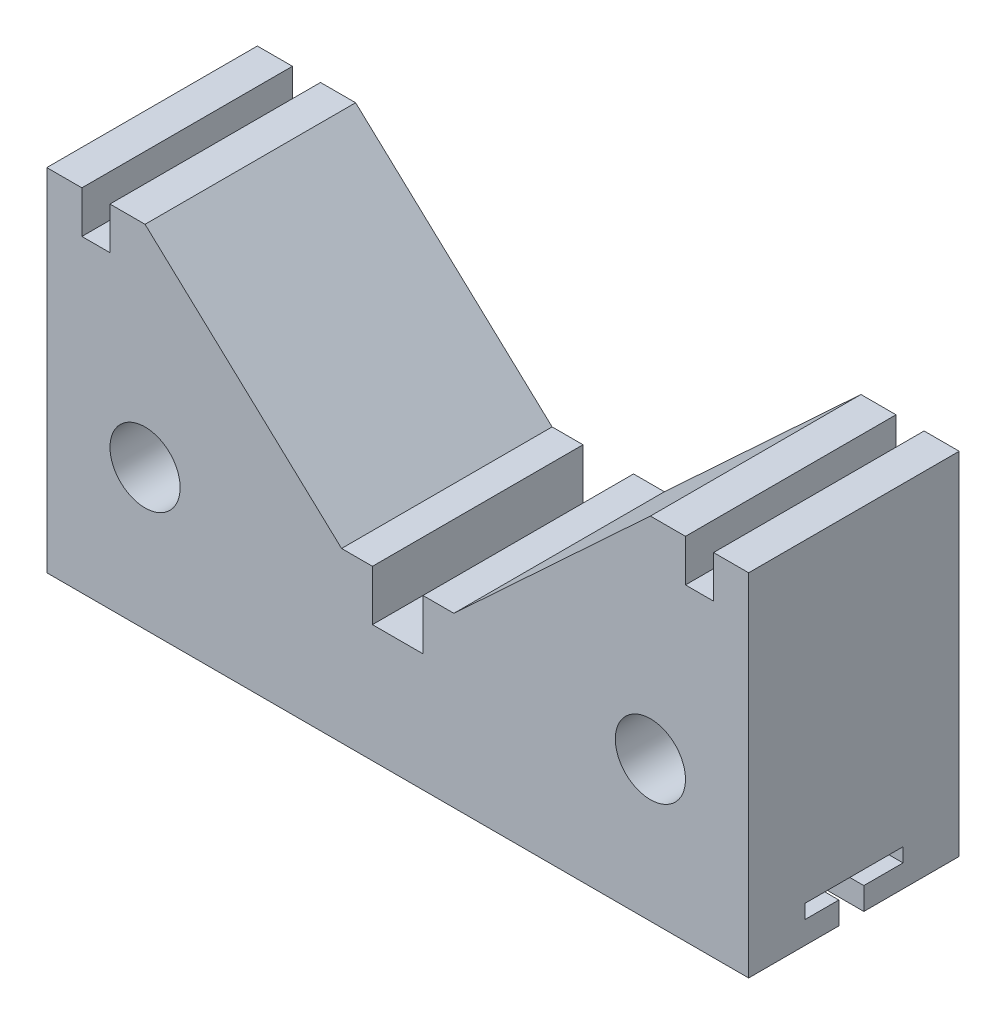
ISO-10303-21;
HEADER;
FILE_DESCRIPTION(('STEP AP214'),'2;1');
FILE_NAME('part.step','',(''),(''),'','','');
FILE_SCHEMA(('AUTOMOTIVE_DESIGN { 1 0 10303 214 1 1 1 1 }'));
ENDSEC;
DATA;
#1=APPLICATION_CONTEXT('core data for automotive mechanical design processes');
#2=APPLICATION_PROTOCOL_DEFINITION('international standard','automotive_design',2000,#1);
#3=PRODUCT_CONTEXT('',#1,'mechanical');
#4=PRODUCT('Part','Part','',(#3));
#5=PRODUCT_RELATED_PRODUCT_CATEGORY('part','',(#4));
#6=PRODUCT_DEFINITION_FORMATION('','',#4);
#7=PRODUCT_DEFINITION_CONTEXT('part definition',#1,'design');
#8=PRODUCT_DEFINITION('design','',#6,#7);
#9=PRODUCT_DEFINITION_SHAPE('','',#8);
#10=(LENGTH_UNIT() NAMED_UNIT(*) SI_UNIT(.MILLI.,.METRE.));
#11=(NAMED_UNIT(*) PLANE_ANGLE_UNIT() SI_UNIT($,.RADIAN.));
#12=(NAMED_UNIT(*) SI_UNIT($,.STERADIAN.) SOLID_ANGLE_UNIT());
#13=UNCERTAINTY_MEASURE_WITH_UNIT(LENGTH_MEASURE(1.E-05),#10,'distance_accuracy_value','');
#14=(GEOMETRIC_REPRESENTATION_CONTEXT(3) GLOBAL_UNCERTAINTY_ASSIGNED_CONTEXT((#13)) GLOBAL_UNIT_ASSIGNED_CONTEXT((#10,
#11,#12)) REPRESENTATION_CONTEXT('',''));
#15=CARTESIAN_POINT('',(0.,0.,0.));
#16=DIRECTION('',(0.,0.,1.));
#17=DIRECTION('',(1.,0.,0.));
#18=AXIS2_PLACEMENT_3D('',#15,#16,#17);
#19=CARTESIAN_POINT('',(-125.,0.,37.5));
#20=DIRECTION('',(0.,1.,0.));
#21=DIRECTION('',(0.,0.,1.));
#22=AXIS2_PLACEMENT_3D('',#19,#20,#21);
#23=PLANE('',#22);
#24=DIRECTION('',(0.,0.,-1.));
#25=VECTOR('',#24,1.);
#26=CARTESIAN_POINT('',(125.,0.,37.5));
#27=LINE('',#26,#25);
#28=CARTESIAN_POINT('',(125.,0.,-3.53011705495498));
#29=VERTEX_POINT('',#28);
#30=CARTESIAN_POINT('',(125.,0.,-37.5));
#31=VERTEX_POINT('',#30);
#32=EDGE_CURVE('E127',#29,#31,#27,.T.);
#33=ORIENTED_EDGE('',*,*,#32,.F.);
#34=DIRECTION('',(-1.,0.,0.));
#35=VECTOR('',#34,1.);
#36=CARTESIAN_POINT('',(-125.,0.,-3.53011705495498));
#37=LINE('',#36,#35);
#38=CARTESIAN_POINT('',(-125.,0.,-3.53011705495498));
#39=VERTEX_POINT('',#38);
#40=EDGE_CURVE('E315',#29,#39,#37,.T.);
#41=ORIENTED_EDGE('',*,*,#40,.T.);
#42=DIRECTION('',(0.,0.,-1.));
#43=VECTOR('',#42,1.);
#44=CARTESIAN_POINT('',(-125.,0.,37.5));
#45=LINE('',#44,#43);
#46=CARTESIAN_POINT('',(-125.,0.,-37.5));
#47=VERTEX_POINT('',#46);
#48=EDGE_CURVE('E263',#39,#47,#45,.T.);
#49=ORIENTED_EDGE('',*,*,#48,.T.);
#50=DIRECTION('',(1.,0.,0.));
#51=VECTOR('',#50,1.);
#52=CARTESIAN_POINT('',(-125.,0.,-37.5));
#53=LINE('',#52,#51);
#54=EDGE_CURVE('E257',#47,#31,#53,.T.);
#55=ORIENTED_EDGE('',*,*,#54,.T.);
#56=EDGE_LOOP('',(#33,#41,#49,#55));
#57=FACE_BOUND('',#56,.T.);
#58=ADVANCED_FACE('F33',(#57),#23,.F.);
#59=CARTESIAN_POINT('',(0.,0.,37.5));
#60=DIRECTION('',(0.,0.,1.));
#61=DIRECTION('',(1.,0.,0.));
#62=AXIS2_PLACEMENT_3D('',#59,#60,#61);
#63=PLANE('',#62);
#64=CARTESIAN_POINT('',(-90.,50.,37.5));
#65=DIRECTION('',(0.,0.,1.));
#66=DIRECTION('',(1.,0.,0.));
#67=AXIS2_PLACEMENT_3D('',#64,#65,#66);
#68=CIRCLE('',#67,12.5);
#69=CARTESIAN_POINT('',(-77.5,50.,37.5));
#70=VERTEX_POINT('',#69);
#71=EDGE_CURVE('E222',#70,#70,#68,.T.);
#72=ORIENTED_EDGE('',*,*,#71,.F.);
#73=EDGE_LOOP('',(#72));
#74=FACE_BOUND('',#73,.T.);
#75=DIRECTION('',(0.,1.,0.));
#76=VECTOR('',#75,1.);
#77=CARTESIAN_POINT('',(125.,0.,37.5));
#78=LINE('',#77,#76);
#79=CARTESIAN_POINT('',(125.,0.,37.5));
#80=VERTEX_POINT('',#79);
#81=CARTESIAN_POINT('',(125.,125.,37.5));
#82=VERTEX_POINT('',#81);
#83=EDGE_CURVE('E259',#80,#82,#78,.T.);
#84=ORIENTED_EDGE('',*,*,#83,.T.);
#85=DIRECTION('',(-1.,0.,0.));
#86=VECTOR('',#85,1.);
#87=CARTESIAN_POINT('',(125.,125.,37.5));
#88=LINE('',#87,#86);
#89=CARTESIAN_POINT('',(112.5,125.,37.5));
#90=VERTEX_POINT('',#89);
#91=EDGE_CURVE('E136',#82,#90,#88,.T.);
#92=ORIENTED_EDGE('',*,*,#91,.T.);
#93=DIRECTION('',(0.,-1.,0.));
#94=VECTOR('',#93,1.);
#95=CARTESIAN_POINT('',(112.5,125.,37.5));
#96=LINE('',#95,#94);
#97=CARTESIAN_POINT('',(112.5,110.,37.5));
#98=VERTEX_POINT('',#97);
#99=EDGE_CURVE('E386',#90,#98,#96,.T.);
#100=ORIENTED_EDGE('',*,*,#99,.T.);
#101=DIRECTION('',(-1.,0.,0.));
#102=VECTOR('',#101,1.);
#103=CARTESIAN_POINT('',(112.5,110.,37.5));
#104=LINE('',#103,#102);
#105=CARTESIAN_POINT('',(102.5,110.,37.5));
#106=VERTEX_POINT('',#105);
#107=EDGE_CURVE('E388',#98,#106,#104,.T.);
#108=ORIENTED_EDGE('',*,*,#107,.T.);
#109=DIRECTION('',(0.,1.,0.));
#110=VECTOR('',#109,1.);
#111=CARTESIAN_POINT('',(102.5,110.,37.5));
#112=LINE('',#111,#110);
#113=CARTESIAN_POINT('',(102.5,125.,37.5));
#114=VERTEX_POINT('',#113);
#115=EDGE_CURVE('E390',#106,#114,#112,.T.);
#116=ORIENTED_EDGE('',*,*,#115,.T.);
#117=DIRECTION('',(-1.,0.,0.));
#118=VECTOR('',#117,1.);
#119=CARTESIAN_POINT('',(102.5,125.,37.5));
#120=LINE('',#119,#118);
#121=CARTESIAN_POINT('',(90.,125.,37.5));
#122=VERTEX_POINT('',#121);
#123=EDGE_CURVE('E392',#114,#122,#120,.T.);
#124=ORIENTED_EDGE('',*,*,#123,.T.);
#125=DIRECTION('',(-0.732793491626299,-0.680451099367278,0.));
#126=VECTOR('',#125,1.);
#127=CARTESIAN_POINT('',(90.,125.,37.5));
#128=LINE('',#127,#126);
#129=CARTESIAN_POINT('',(20.,60.,37.5));
#130=VERTEX_POINT('',#129);
#131=EDGE_CURVE('E394',#122,#130,#128,.T.);
#132=ORIENTED_EDGE('',*,*,#131,.T.);
#133=DIRECTION('',(-1.,0.,0.));
#134=VECTOR('',#133,1.);
#135=CARTESIAN_POINT('',(20.,60.,37.5));
#136=LINE('',#135,#134);
#137=CARTESIAN_POINT('',(8.99999999999999,60.,37.5));
#138=VERTEX_POINT('',#137);
#139=EDGE_CURVE('E396',#130,#138,#136,.T.);
#140=ORIENTED_EDGE('',*,*,#139,.T.);
#141=DIRECTION('',(0.,-1.,0.));
#142=VECTOR('',#141,1.);
#143=CARTESIAN_POINT('',(8.99999999999999,60.,37.5));
#144=LINE('',#143,#142);
#145=CARTESIAN_POINT('',(9.,42.,37.5));
#146=VERTEX_POINT('',#145);
#147=EDGE_CURVE('E398',#138,#146,#144,.T.);
#148=ORIENTED_EDGE('',*,*,#147,.T.);
#149=DIRECTION('',(-1.,0.,0.));
#150=VECTOR('',#149,1.);
#151=CARTESIAN_POINT('',(9.,42.,37.5));
#152=LINE('',#151,#150);
#153=CARTESIAN_POINT('',(-9.,42.,37.5));
#154=VERTEX_POINT('',#153);
#155=EDGE_CURVE('E400',#146,#154,#152,.T.);
#156=ORIENTED_EDGE('',*,*,#155,.T.);
#157=DIRECTION('',(0.,1.,0.));
#158=VECTOR('',#157,1.);
#159=CARTESIAN_POINT('',(-8.99999999999999,60.,37.5));
#160=LINE('',#159,#158);
#161=CARTESIAN_POINT('',(-8.99999999999999,60.,37.5));
#162=VERTEX_POINT('',#161);
#163=EDGE_CURVE('E402',#154,#162,#160,.T.);
#164=ORIENTED_EDGE('',*,*,#163,.T.);
#165=DIRECTION('',(-1.,0.,0.));
#166=VECTOR('',#165,1.);
#167=CARTESIAN_POINT('',(-20.,60.,37.5));
#168=LINE('',#167,#166);
#169=CARTESIAN_POINT('',(-20.,60.,37.5));
#170=VERTEX_POINT('',#169);
#171=EDGE_CURVE('E404',#162,#170,#168,.T.);
#172=ORIENTED_EDGE('',*,*,#171,.T.);
#173=DIRECTION('',(-0.732793491626299,0.680451099367277,0.));
#174=VECTOR('',#173,1.);
#175=CARTESIAN_POINT('',(-90.,125.,37.5));
#176=LINE('',#175,#174);
#177=CARTESIAN_POINT('',(-90.,125.,37.5));
#178=VERTEX_POINT('',#177);
#179=EDGE_CURVE('E406',#170,#178,#176,.T.);
#180=ORIENTED_EDGE('',*,*,#179,.T.);
#181=DIRECTION('',(-1.,0.,0.));
#182=VECTOR('',#181,1.);
#183=CARTESIAN_POINT('',(-102.5,125.,37.5));
#184=LINE('',#183,#182);
#185=CARTESIAN_POINT('',(-102.5,125.,37.5));
#186=VERTEX_POINT('',#185);
#187=EDGE_CURVE('E408',#178,#186,#184,.T.);
#188=ORIENTED_EDGE('',*,*,#187,.T.);
#189=DIRECTION('',(0.,-1.,0.));
#190=VECTOR('',#189,1.);
#191=CARTESIAN_POINT('',(-102.5,110.,37.5));
#192=LINE('',#191,#190);
#193=CARTESIAN_POINT('',(-102.5,110.,37.5));
#194=VERTEX_POINT('',#193);
#195=EDGE_CURVE('E410',#186,#194,#192,.T.);
#196=ORIENTED_EDGE('',*,*,#195,.T.);
#197=DIRECTION('',(-1.,0.,0.));
#198=VECTOR('',#197,1.);
#199=CARTESIAN_POINT('',(-112.5,110.,37.5));
#200=LINE('',#199,#198);
#201=CARTESIAN_POINT('',(-112.5,110.,37.5));
#202=VERTEX_POINT('',#201);
#203=EDGE_CURVE('E412',#194,#202,#200,.T.);
#204=ORIENTED_EDGE('',*,*,#203,.T.);
#205=DIRECTION('',(0.,1.,0.));
#206=VECTOR('',#205,1.);
#207=CARTESIAN_POINT('',(-112.5,125.,37.5));
#208=LINE('',#207,#206);
#209=CARTESIAN_POINT('',(-112.5,125.,37.5));
#210=VERTEX_POINT('',#209);
#211=EDGE_CURVE('E195',#202,#210,#208,.T.);
#212=ORIENTED_EDGE('',*,*,#211,.T.);
#213=DIRECTION('',(-1.,0.,0.));
#214=VECTOR('',#213,1.);
#215=CARTESIAN_POINT('',(-125.,125.,37.5));
#216=LINE('',#215,#214);
#217=CARTESIAN_POINT('',(-125.,125.,37.5));
#218=VERTEX_POINT('',#217);
#219=EDGE_CURVE('E187',#210,#218,#216,.T.);
#220=ORIENTED_EDGE('',*,*,#219,.T.);
#221=DIRECTION('',(0.,-1.,0.));
#222=VECTOR('',#221,1.);
#223=CARTESIAN_POINT('',(-125.,0.,37.5));
#224=LINE('',#223,#222);
#225=CARTESIAN_POINT('',(-125.,0.,37.5));
#226=VERTEX_POINT('',#225);
#227=EDGE_CURVE('E192',#218,#226,#224,.T.);
#228=ORIENTED_EDGE('',*,*,#227,.T.);
#229=DIRECTION('',(1.,0.,0.));
#230=VECTOR('',#229,1.);
#231=CARTESIAN_POINT('',(-125.,0.,37.5));
#232=LINE('',#231,#230);
#233=EDGE_CURVE('E57',#226,#80,#232,.T.);
#234=ORIENTED_EDGE('',*,*,#233,.T.);
#235=EDGE_LOOP('',(#84,#92,#100,#108,#116,#124,#132,#140,#148,#156,#164,#172,#180,#188,#196,
#204,#212,#220,#228,#234));
#236=FACE_BOUND('',#235,.T.);
#237=CARTESIAN_POINT('',(90.,50.,37.5));
#238=DIRECTION('',(0.,0.,1.));
#239=DIRECTION('',(1.,0.,0.));
#240=AXIS2_PLACEMENT_3D('',#237,#238,#239);
#241=CIRCLE('',#240,12.5);
#242=CARTESIAN_POINT('',(102.5,50.,37.5));
#243=VERTEX_POINT('',#242);
#244=EDGE_CURVE('E374',#243,#243,#241,.T.);
#245=ORIENTED_EDGE('',*,*,#244,.F.);
#246=EDGE_LOOP('',(#245));
#247=FACE_BOUND('',#246,.T.);
#248=ADVANCED_FACE('F189',(#74,#236,#247),#63,.T.);
#249=CARTESIAN_POINT('',(0.,0.,-37.5));
#250=DIRECTION('',(0.,0.,1.));
#251=DIRECTION('',(1.,0.,0.));
#252=AXIS2_PLACEMENT_3D('',#249,#250,#251);
#253=PLANE('',#252);
#254=DIRECTION('',(0.,1.,0.));
#255=VECTOR('',#254,1.);
#256=CARTESIAN_POINT('',(125.,0.,-37.5));
#257=LINE('',#256,#255);
#258=CARTESIAN_POINT('',(125.,125.,-37.5));
#259=VERTEX_POINT('',#258);
#260=EDGE_CURVE('E219',#31,#259,#257,.T.);
#261=ORIENTED_EDGE('',*,*,#260,.F.);
#262=ORIENTED_EDGE('',*,*,#54,.F.);
#263=DIRECTION('',(0.,-1.,0.));
#264=VECTOR('',#263,1.);
#265=CARTESIAN_POINT('',(-125.,0.,-37.5));
#266=LINE('',#265,#264);
#267=CARTESIAN_POINT('',(-125.,125.,-37.5));
#268=VERTEX_POINT('',#267);
#269=EDGE_CURVE('E255',#268,#47,#266,.T.);
#270=ORIENTED_EDGE('',*,*,#269,.F.);
#271=DIRECTION('',(-1.,0.,0.));
#272=VECTOR('',#271,1.);
#273=CARTESIAN_POINT('',(-125.,125.,-37.5));
#274=LINE('',#273,#272);
#275=CARTESIAN_POINT('',(-112.5,125.,-37.5));
#276=VERTEX_POINT('',#275);
#277=EDGE_CURVE('E204',#276,#268,#274,.T.);
#278=ORIENTED_EDGE('',*,*,#277,.F.);
#279=DIRECTION('',(0.,1.,0.));
#280=VECTOR('',#279,1.);
#281=CARTESIAN_POINT('',(-112.5,125.,-37.5));
#282=LINE('',#281,#280);
#283=CARTESIAN_POINT('',(-112.5,110.,-37.5));
#284=VERTEX_POINT('',#283);
#285=EDGE_CURVE('E252',#284,#276,#282,.T.);
#286=ORIENTED_EDGE('',*,*,#285,.F.);
#287=DIRECTION('',(-1.,0.,0.));
#288=VECTOR('',#287,1.);
#289=CARTESIAN_POINT('',(-112.5,110.,-37.5));
#290=LINE('',#289,#288);
#291=CARTESIAN_POINT('',(-102.5,110.,-37.5));
#292=VERTEX_POINT('',#291);
#293=EDGE_CURVE('E250',#292,#284,#290,.T.);
#294=ORIENTED_EDGE('',*,*,#293,.F.);
#295=DIRECTION('',(0.,-1.,0.));
#296=VECTOR('',#295,1.);
#297=CARTESIAN_POINT('',(-102.5,110.,-37.5));
#298=LINE('',#297,#296);
#299=CARTESIAN_POINT('',(-102.5,125.,-37.5));
#300=VERTEX_POINT('',#299);
#301=EDGE_CURVE('E248',#300,#292,#298,.T.);
#302=ORIENTED_EDGE('',*,*,#301,.F.);
#303=DIRECTION('',(-1.,0.,0.));
#304=VECTOR('',#303,1.);
#305=CARTESIAN_POINT('',(-102.5,125.,-37.5));
#306=LINE('',#305,#304);
#307=CARTESIAN_POINT('',(-90.,125.,-37.5));
#308=VERTEX_POINT('',#307);
#309=EDGE_CURVE('E246',#308,#300,#306,.T.);
#310=ORIENTED_EDGE('',*,*,#309,.F.);
#311=DIRECTION('',(-0.732793491626299,0.680451099367277,0.));
#312=VECTOR('',#311,1.);
#313=CARTESIAN_POINT('',(-90.,125.,-37.5));
#314=LINE('',#313,#312);
#315=CARTESIAN_POINT('',(-20.,60.,-37.5));
#316=VERTEX_POINT('',#315);
#317=EDGE_CURVE('E244',#316,#308,#314,.T.);
#318=ORIENTED_EDGE('',*,*,#317,.F.);
#319=DIRECTION('',(-1.,0.,0.));
#320=VECTOR('',#319,1.);
#321=CARTESIAN_POINT('',(-20.,60.,-37.5));
#322=LINE('',#321,#320);
#323=CARTESIAN_POINT('',(-8.99999999999999,60.,-37.5));
#324=VERTEX_POINT('',#323);
#325=EDGE_CURVE('E242',#324,#316,#322,.T.);
#326=ORIENTED_EDGE('',*,*,#325,.F.);
#327=DIRECTION('',(0.,1.,0.));
#328=VECTOR('',#327,1.);
#329=CARTESIAN_POINT('',(-8.99999999999999,60.,-37.5));
#330=LINE('',#329,#328);
#331=CARTESIAN_POINT('',(-9.,42.,-37.5));
#332=VERTEX_POINT('',#331);
#333=EDGE_CURVE('E240',#332,#324,#330,.T.);
#334=ORIENTED_EDGE('',*,*,#333,.F.);
#335=DIRECTION('',(-1.,0.,0.));
#336=VECTOR('',#335,1.);
#337=CARTESIAN_POINT('',(9.,42.,-37.5));
#338=LINE('',#337,#336);
#339=CARTESIAN_POINT('',(9.,42.,-37.5));
#340=VERTEX_POINT('',#339);
#341=EDGE_CURVE('E238',#340,#332,#338,.T.);
#342=ORIENTED_EDGE('',*,*,#341,.F.);
#343=DIRECTION('',(0.,-1.,0.));
#344=VECTOR('',#343,1.);
#345=CARTESIAN_POINT('',(8.99999999999999,60.,-37.5));
#346=LINE('',#345,#344);
#347=CARTESIAN_POINT('',(8.99999999999999,60.,-37.5));
#348=VERTEX_POINT('',#347);
#349=EDGE_CURVE('E236',#348,#340,#346,.T.);
#350=ORIENTED_EDGE('',*,*,#349,.F.);
#351=DIRECTION('',(-1.,0.,0.));
#352=VECTOR('',#351,1.);
#353=CARTESIAN_POINT('',(20.,60.,-37.5));
#354=LINE('',#353,#352);
#355=CARTESIAN_POINT('',(20.,60.,-37.5));
#356=VERTEX_POINT('',#355);
#357=EDGE_CURVE('E234',#356,#348,#354,.T.);
#358=ORIENTED_EDGE('',*,*,#357,.F.);
#359=DIRECTION('',(-0.732793491626299,-0.680451099367278,0.));
#360=VECTOR('',#359,1.);
#361=CARTESIAN_POINT('',(90.,125.,-37.5));
#362=LINE('',#361,#360);
#363=CARTESIAN_POINT('',(90.,125.,-37.5));
#364=VERTEX_POINT('',#363);
#365=EDGE_CURVE('E232',#364,#356,#362,.T.);
#366=ORIENTED_EDGE('',*,*,#365,.F.);
#367=DIRECTION('',(-1.,0.,0.));
#368=VECTOR('',#367,1.);
#369=CARTESIAN_POINT('',(102.5,125.,-37.5));
#370=LINE('',#369,#368);
#371=CARTESIAN_POINT('',(102.5,125.,-37.5));
#372=VERTEX_POINT('',#371);
#373=EDGE_CURVE('E230',#372,#364,#370,.T.);
#374=ORIENTED_EDGE('',*,*,#373,.F.);
#375=DIRECTION('',(0.,1.,0.));
#376=VECTOR('',#375,1.);
#377=CARTESIAN_POINT('',(102.5,110.,-37.5));
#378=LINE('',#377,#376);
#379=CARTESIAN_POINT('',(102.5,110.,-37.5));
#380=VERTEX_POINT('',#379);
#381=EDGE_CURVE('E228',#380,#372,#378,.T.);
#382=ORIENTED_EDGE('',*,*,#381,.F.);
#383=DIRECTION('',(-1.,0.,0.));
#384=VECTOR('',#383,1.);
#385=CARTESIAN_POINT('',(112.5,110.,-37.5));
#386=LINE('',#385,#384);
#387=CARTESIAN_POINT('',(112.5,110.,-37.5));
#388=VERTEX_POINT('',#387);
#389=EDGE_CURVE('E226',#388,#380,#386,.T.);
#390=ORIENTED_EDGE('',*,*,#389,.F.);
#391=DIRECTION('',(0.,-1.,0.));
#392=VECTOR('',#391,1.);
#393=CARTESIAN_POINT('',(112.5,125.,-37.5));
#394=LINE('',#393,#392);
#395=CARTESIAN_POINT('',(112.5,125.,-37.5));
#396=VERTEX_POINT('',#395);
#397=EDGE_CURVE('E224',#396,#388,#394,.T.);
#398=ORIENTED_EDGE('',*,*,#397,.F.);
#399=DIRECTION('',(-1.,0.,0.));
#400=VECTOR('',#399,1.);
#401=CARTESIAN_POINT('',(125.,125.,-37.5));
#402=LINE('',#401,#400);
#403=EDGE_CURVE('E221',#259,#396,#402,.T.);
#404=ORIENTED_EDGE('',*,*,#403,.F.);
#405=EDGE_LOOP('',(#261,#262,#270,#278,#286,#294,#302,#310,#318,#326,#334,#342,#350,#358,#366,
#374,#382,#390,#398,#404));
#406=FACE_BOUND('',#405,.T.);
#407=CARTESIAN_POINT('',(-90.,50.,-37.5));
#408=DIRECTION('',(0.,0.,1.));
#409=DIRECTION('',(1.,0.,0.));
#410=AXIS2_PLACEMENT_3D('',#407,#408,#409);
#411=CIRCLE('',#410,12.5);
#412=CARTESIAN_POINT('',(-77.5,50.,-37.5));
#413=VERTEX_POINT('',#412);
#414=EDGE_CURVE('E377',#413,#413,#411,.T.);
#415=ORIENTED_EDGE('',*,*,#414,.T.);
#416=EDGE_LOOP('',(#415));
#417=FACE_BOUND('',#416,.T.);
#418=CARTESIAN_POINT('',(90.,50.,-37.5));
#419=DIRECTION('',(0.,0.,1.));
#420=DIRECTION('',(1.,0.,0.));
#421=AXIS2_PLACEMENT_3D('',#418,#419,#420);
#422=CIRCLE('',#421,12.5);
#423=CARTESIAN_POINT('',(102.5,50.,-37.5));
#424=VERTEX_POINT('',#423);
#425=EDGE_CURVE('E373',#424,#424,#422,.T.);
#426=ORIENTED_EDGE('',*,*,#425,.T.);
#427=EDGE_LOOP('',(#426));
#428=FACE_BOUND('',#427,.T.);
#429=ADVANCED_FACE('F425',(#406,#417,#428),#253,.F.);
#430=CARTESIAN_POINT('',(125.,0.,37.5));
#431=DIRECTION('',(-1.,0.,0.));
#432=DIRECTION('',(0.,-1.,0.));
#433=AXIS2_PLACEMENT_3D('',#430,#431,#432);
#434=PLANE('',#433);
#435=DIRECTION('',(0.,0.,-1.));
#436=VECTOR('',#435,1.);
#437=CARTESIAN_POINT('',(125.,8.,-17.5));
#438=LINE('',#437,#436);
#439=CARTESIAN_POINT('',(125.,7.99999999999999,-3.53011705495498));
#440=VERTEX_POINT('',#439);
#441=CARTESIAN_POINT('',(125.,8.,-17.5));
#442=VERTEX_POINT('',#441);
#443=EDGE_CURVE('E352',#440,#442,#438,.T.);
#444=ORIENTED_EDGE('',*,*,#443,.F.);
#445=DIRECTION('',(0.,1.,0.));
#446=VECTOR('',#445,1.);
#447=CARTESIAN_POINT('',(125.,7.99999999999999,-3.53011705495498));
#448=LINE('',#447,#446);
#449=EDGE_CURVE('E439',#29,#440,#448,.T.);
#450=ORIENTED_EDGE('',*,*,#449,.F.);
#451=ORIENTED_EDGE('',*,*,#32,.T.);
#452=ORIENTED_EDGE('',*,*,#260,.T.);
#453=DIRECTION('',(0.,0.,-1.));
#454=VECTOR('',#453,1.);
#455=CARTESIAN_POINT('',(125.,125.,37.5));
#456=LINE('',#455,#454);
#457=EDGE_CURVE('E311',#82,#259,#456,.T.);
#458=ORIENTED_EDGE('',*,*,#457,.F.);
#459=ORIENTED_EDGE('',*,*,#83,.F.);
#460=CARTESIAN_POINT('',(125.,0.,5.37352847858968));
#461=VERTEX_POINT('',#460);
#462=EDGE_CURVE('E260',#80,#461,#27,.T.);
#463=ORIENTED_EDGE('',*,*,#462,.T.);
#464=DIRECTION('',(0.,-1.,0.));
#465=VECTOR('',#464,1.);
#466=CARTESIAN_POINT('',(125.,7.99999999999999,5.37352847858969));
#467=LINE('',#466,#465);
#468=CARTESIAN_POINT('',(125.,7.99999999999999,5.37352847858969));
#469=VERTEX_POINT('',#468);
#470=EDGE_CURVE('E48',#469,#461,#467,.T.);
#471=ORIENTED_EDGE('',*,*,#470,.F.);
#472=DIRECTION('',(0.,0.,-1.));
#473=VECTOR('',#472,1.);
#474=CARTESIAN_POINT('',(125.,7.99999999999999,17.5));
#475=LINE('',#474,#473);
#476=CARTESIAN_POINT('',(125.,7.99999999999999,17.5));
#477=VERTEX_POINT('',#476);
#478=EDGE_CURVE('E442',#477,#469,#475,.T.);
#479=ORIENTED_EDGE('',*,*,#478,.F.);
#480=DIRECTION('',(0.,-1.,0.));
#481=VECTOR('',#480,1.);
#482=CARTESIAN_POINT('',(125.,13.,17.5));
#483=LINE('',#482,#481);
#484=CARTESIAN_POINT('',(125.,13.,17.5));
#485=VERTEX_POINT('',#484);
#486=EDGE_CURVE('E447',#485,#477,#483,.T.);
#487=ORIENTED_EDGE('',*,*,#486,.F.);
#488=DIRECTION('',(0.,0.,1.));
#489=VECTOR('',#488,1.);
#490=CARTESIAN_POINT('',(125.,13.,17.5));
#491=LINE('',#490,#489);
#492=CARTESIAN_POINT('',(125.,13.,-17.5));
#493=VERTEX_POINT('',#492);
#494=EDGE_CURVE('E450',#493,#485,#491,.T.);
#495=ORIENTED_EDGE('',*,*,#494,.F.);
#496=DIRECTION('',(0.,1.,0.));
#497=VECTOR('',#496,1.);
#498=CARTESIAN_POINT('',(125.,13.,-17.5));
#499=LINE('',#498,#497);
#500=EDGE_CURVE('E453',#442,#493,#499,.T.);
#501=ORIENTED_EDGE('',*,*,#500,.F.);
#502=EDGE_LOOP('',(#444,#450,#451,#452,#458,#459,#463,#471,#479,#487,#495,#501));
#503=FACE_BOUND('',#502,.T.);
#504=ADVANCED_FACE('F35',(#503),#434,.F.);
#505=CARTESIAN_POINT('',(125.,125.,37.5));
#506=DIRECTION('',(0.,-1.,0.));
#507=DIRECTION('',(1.,0.,0.));
#508=AXIS2_PLACEMENT_3D('',#505,#506,#507);
#509=PLANE('',#508);
#510=ORIENTED_EDGE('',*,*,#403,.T.);
#511=DIRECTION('',(0.,0.,-1.));
#512=VECTOR('',#511,1.);
#513=CARTESIAN_POINT('',(112.5,125.,37.5));
#514=LINE('',#513,#512);
#515=EDGE_CURVE('E308',#90,#396,#514,.T.);
#516=ORIENTED_EDGE('',*,*,#515,.F.);
#517=ORIENTED_EDGE('',*,*,#91,.F.);
#518=ORIENTED_EDGE('',*,*,#457,.T.);
#519=EDGE_LOOP('',(#510,#516,#517,#518));
#520=FACE_BOUND('',#519,.T.);
#521=ADVANCED_FACE('F572',(#520),#509,.F.);
#522=CARTESIAN_POINT('',(112.5,125.,37.5));
#523=DIRECTION('',(1.,0.,0.));
#524=DIRECTION('',(0.,1.,0.));
#525=AXIS2_PLACEMENT_3D('',#522,#523,#524);
#526=PLANE('',#525);
#527=ORIENTED_EDGE('',*,*,#397,.T.);
#528=DIRECTION('',(0.,0.,-1.));
#529=VECTOR('',#528,1.);
#530=CARTESIAN_POINT('',(112.5,110.,37.5));
#531=LINE('',#530,#529);
#532=EDGE_CURVE('E305',#98,#388,#531,.T.);
#533=ORIENTED_EDGE('',*,*,#532,.F.);
#534=ORIENTED_EDGE('',*,*,#99,.F.);
#535=ORIENTED_EDGE('',*,*,#515,.T.);
#536=EDGE_LOOP('',(#527,#533,#534,#535));
#537=FACE_BOUND('',#536,.T.);
#538=ADVANCED_FACE('F569',(#537),#526,.F.);
#539=CARTESIAN_POINT('',(112.5,110.,37.5));
#540=DIRECTION('',(0.,-1.,0.));
#541=DIRECTION('',(0.,0.,-1.));
#542=AXIS2_PLACEMENT_3D('',#539,#540,#541);
#543=PLANE('',#542);
#544=ORIENTED_EDGE('',*,*,#389,.T.);
#545=DIRECTION('',(0.,0.,-1.));
#546=VECTOR('',#545,1.);
#547=CARTESIAN_POINT('',(102.5,110.,37.5));
#548=LINE('',#547,#546);
#549=EDGE_CURVE('E302',#106,#380,#548,.T.);
#550=ORIENTED_EDGE('',*,*,#549,.F.);
#551=ORIENTED_EDGE('',*,*,#107,.F.);
#552=ORIENTED_EDGE('',*,*,#532,.T.);
#553=EDGE_LOOP('',(#544,#550,#551,#552));
#554=FACE_BOUND('',#553,.T.);
#555=ADVANCED_FACE('F565',(#554),#543,.F.);
#556=CARTESIAN_POINT('',(102.5,110.,37.5));
#557=DIRECTION('',(-1.,0.,0.));
#558=DIRECTION('',(0.,0.,1.));
#559=AXIS2_PLACEMENT_3D('',#556,#557,#558);
#560=PLANE('',#559);
#561=ORIENTED_EDGE('',*,*,#381,.T.);
#562=DIRECTION('',(0.,0.,-1.));
#563=VECTOR('',#562,1.);
#564=CARTESIAN_POINT('',(102.5,125.,37.5));
#565=LINE('',#564,#563);
#566=EDGE_CURVE('E299',#114,#372,#565,.T.);
#567=ORIENTED_EDGE('',*,*,#566,.F.);
#568=ORIENTED_EDGE('',*,*,#115,.F.);
#569=ORIENTED_EDGE('',*,*,#549,.T.);
#570=EDGE_LOOP('',(#561,#567,#568,#569));
#571=FACE_BOUND('',#570,.T.);
#572=ADVANCED_FACE('F561',(#571),#560,.F.);
#573=CARTESIAN_POINT('',(102.5,125.,37.5));
#574=DIRECTION('',(0.,-1.,0.));
#575=DIRECTION('',(1.,0.,0.));
#576=AXIS2_PLACEMENT_3D('',#573,#574,#575);
#577=PLANE('',#576);
#578=ORIENTED_EDGE('',*,*,#373,.T.);
#579=DIRECTION('',(0.,0.,-1.));
#580=VECTOR('',#579,1.);
#581=CARTESIAN_POINT('',(90.,125.,37.5));
#582=LINE('',#581,#580);
#583=EDGE_CURVE('E296',#122,#364,#582,.T.);
#584=ORIENTED_EDGE('',*,*,#583,.F.);
#585=ORIENTED_EDGE('',*,*,#123,.F.);
#586=ORIENTED_EDGE('',*,*,#566,.T.);
#587=EDGE_LOOP('',(#578,#584,#585,#586));
#588=FACE_BOUND('',#587,.T.);
#589=ADVANCED_FACE('F557',(#588),#577,.F.);
#590=CARTESIAN_POINT('',(90.,125.,37.5));
#591=DIRECTION('',(0.680451099367278,-0.732793491626299,0.));
#592=DIRECTION('',(0.732793491626299,0.680451099367278,0.));
#593=AXIS2_PLACEMENT_3D('',#590,#591,#592);
#594=PLANE('',#593);
#595=ORIENTED_EDGE('',*,*,#365,.T.);
#596=DIRECTION('',(0.,0.,-1.));
#597=VECTOR('',#596,1.);
#598=CARTESIAN_POINT('',(20.,60.,37.5));
#599=LINE('',#598,#597);
#600=EDGE_CURVE('E293',#130,#356,#599,.T.);
#601=ORIENTED_EDGE('',*,*,#600,.F.);
#602=ORIENTED_EDGE('',*,*,#131,.F.);
#603=ORIENTED_EDGE('',*,*,#583,.T.);
#604=EDGE_LOOP('',(#595,#601,#602,#603));
#605=FACE_BOUND('',#604,.T.);
#606=ADVANCED_FACE('F553',(#605),#594,.F.);
#607=CARTESIAN_POINT('',(20.,60.,37.5));
#608=DIRECTION('',(0.,-1.,0.));
#609=DIRECTION('',(1.,0.,0.));
#610=AXIS2_PLACEMENT_3D('',#607,#608,#609);
#611=PLANE('',#610);
#612=ORIENTED_EDGE('',*,*,#357,.T.);
#613=DIRECTION('',(0.,0.,-1.));
#614=VECTOR('',#613,1.);
#615=CARTESIAN_POINT('',(8.99999999999999,60.,37.5));
#616=LINE('',#615,#614);
#617=EDGE_CURVE('E290',#138,#348,#616,.T.);
#618=ORIENTED_EDGE('',*,*,#617,.F.);
#619=ORIENTED_EDGE('',*,*,#139,.F.);
#620=ORIENTED_EDGE('',*,*,#600,.T.);
#621=EDGE_LOOP('',(#612,#618,#619,#620));
#622=FACE_BOUND('',#621,.T.);
#623=ADVANCED_FACE('F549',(#622),#611,.F.);
#624=CARTESIAN_POINT('',(8.99999999999999,60.,37.5));
#625=DIRECTION('',(1.,0.,0.));
#626=DIRECTION('',(0.,1.,0.));
#627=AXIS2_PLACEMENT_3D('',#624,#625,#626);
#628=PLANE('',#627);
#629=ORIENTED_EDGE('',*,*,#349,.T.);
#630=DIRECTION('',(0.,0.,-1.));
#631=VECTOR('',#630,1.);
#632=CARTESIAN_POINT('',(9.,42.,37.5));
#633=LINE('',#632,#631);
#634=EDGE_CURVE('E287',#146,#340,#633,.T.);
#635=ORIENTED_EDGE('',*,*,#634,.F.);
#636=ORIENTED_EDGE('',*,*,#147,.F.);
#637=ORIENTED_EDGE('',*,*,#617,.T.);
#638=EDGE_LOOP('',(#629,#635,#636,#637));
#639=FACE_BOUND('',#638,.T.);
#640=ADVANCED_FACE('F545',(#639),#628,.F.);
#641=CARTESIAN_POINT('',(9.,42.,37.5));
#642=DIRECTION('',(0.,-1.,0.));
#643=DIRECTION('',(0.,0.,-1.));
#644=AXIS2_PLACEMENT_3D('',#641,#642,#643);
#645=PLANE('',#644);
#646=ORIENTED_EDGE('',*,*,#341,.T.);
#647=DIRECTION('',(0.,0.,-1.));
#648=VECTOR('',#647,1.);
#649=CARTESIAN_POINT('',(-9.,42.,37.5));
#650=LINE('',#649,#648);
#651=EDGE_CURVE('E284',#154,#332,#650,.T.);
#652=ORIENTED_EDGE('',*,*,#651,.F.);
#653=ORIENTED_EDGE('',*,*,#155,.F.);
#654=ORIENTED_EDGE('',*,*,#634,.T.);
#655=EDGE_LOOP('',(#646,#652,#653,#654));
#656=FACE_BOUND('',#655,.T.);
#657=ADVANCED_FACE('F541',(#656),#645,.F.);
#658=CARTESIAN_POINT('',(-8.99999999999999,60.,37.5));
#659=DIRECTION('',(-1.,0.,0.));
#660=DIRECTION('',(0.,-1.,0.));
#661=AXIS2_PLACEMENT_3D('',#658,#659,#660);
#662=PLANE('',#661);
#663=ORIENTED_EDGE('',*,*,#333,.T.);
#664=DIRECTION('',(0.,0.,-1.));
#665=VECTOR('',#664,1.);
#666=CARTESIAN_POINT('',(-8.99999999999999,60.,37.5));
#667=LINE('',#666,#665);
#668=EDGE_CURVE('E281',#162,#324,#667,.T.);
#669=ORIENTED_EDGE('',*,*,#668,.F.);
#670=ORIENTED_EDGE('',*,*,#163,.F.);
#671=ORIENTED_EDGE('',*,*,#651,.T.);
#672=EDGE_LOOP('',(#663,#669,#670,#671));
#673=FACE_BOUND('',#672,.T.);
#674=ADVANCED_FACE('F537',(#673),#662,.F.);
#675=CARTESIAN_POINT('',(-20.,60.,37.5));
#676=DIRECTION('',(0.,-1.,0.));
#677=DIRECTION('',(1.,0.,0.));
#678=AXIS2_PLACEMENT_3D('',#675,#676,#677);
#679=PLANE('',#678);
#680=ORIENTED_EDGE('',*,*,#325,.T.);
#681=DIRECTION('',(0.,0.,-1.));
#682=VECTOR('',#681,1.);
#683=CARTESIAN_POINT('',(-20.,60.,37.5));
#684=LINE('',#683,#682);
#685=EDGE_CURVE('E278',#170,#316,#684,.T.);
#686=ORIENTED_EDGE('',*,*,#685,.F.);
#687=ORIENTED_EDGE('',*,*,#171,.F.);
#688=ORIENTED_EDGE('',*,*,#668,.T.);
#689=EDGE_LOOP('',(#680,#686,#687,#688));
#690=FACE_BOUND('',#689,.T.);
#691=ADVANCED_FACE('F533',(#690),#679,.F.);
#692=CARTESIAN_POINT('',(-90.,125.,37.5));
#693=DIRECTION('',(-0.680451099367277,-0.732793491626299,0.));
#694=DIRECTION('',(0.732793491626299,-0.680451099367277,0.));
#695=AXIS2_PLACEMENT_3D('',#692,#693,#694);
#696=PLANE('',#695);
#697=ORIENTED_EDGE('',*,*,#317,.T.);
#698=DIRECTION('',(0.,0.,-1.));
#699=VECTOR('',#698,1.);
#700=CARTESIAN_POINT('',(-90.,125.,37.5));
#701=LINE('',#700,#699);
#702=EDGE_CURVE('E275',#178,#308,#701,.T.);
#703=ORIENTED_EDGE('',*,*,#702,.F.);
#704=ORIENTED_EDGE('',*,*,#179,.F.);
#705=ORIENTED_EDGE('',*,*,#685,.T.);
#706=EDGE_LOOP('',(#697,#703,#704,#705));
#707=FACE_BOUND('',#706,.T.);
#708=ADVANCED_FACE('F529',(#707),#696,.F.);
#709=CARTESIAN_POINT('',(-102.5,125.,37.5));
#710=DIRECTION('',(0.,-1.,0.));
#711=DIRECTION('',(1.,0.,0.));
#712=AXIS2_PLACEMENT_3D('',#709,#710,#711);
#713=PLANE('',#712);
#714=ORIENTED_EDGE('',*,*,#309,.T.);
#715=DIRECTION('',(0.,0.,-1.));
#716=VECTOR('',#715,1.);
#717=CARTESIAN_POINT('',(-102.5,125.,37.5));
#718=LINE('',#717,#716);
#719=EDGE_CURVE('E272',#186,#300,#718,.T.);
#720=ORIENTED_EDGE('',*,*,#719,.F.);
#721=ORIENTED_EDGE('',*,*,#187,.F.);
#722=ORIENTED_EDGE('',*,*,#702,.T.);
#723=EDGE_LOOP('',(#714,#720,#721,#722));
#724=FACE_BOUND('',#723,.T.);
#725=ADVANCED_FACE('F525',(#724),#713,.F.);
#726=CARTESIAN_POINT('',(-102.5,110.,37.5));
#727=DIRECTION('',(1.,0.,0.));
#728=DIRECTION('',(0.,1.,0.));
#729=AXIS2_PLACEMENT_3D('',#726,#727,#728);
#730=PLANE('',#729);
#731=ORIENTED_EDGE('',*,*,#301,.T.);
#732=DIRECTION('',(0.,0.,-1.));
#733=VECTOR('',#732,1.);
#734=CARTESIAN_POINT('',(-102.5,110.,37.5));
#735=LINE('',#734,#733);
#736=EDGE_CURVE('E269',#194,#292,#735,.T.);
#737=ORIENTED_EDGE('',*,*,#736,.F.);
#738=ORIENTED_EDGE('',*,*,#195,.F.);
#739=ORIENTED_EDGE('',*,*,#719,.T.);
#740=EDGE_LOOP('',(#731,#737,#738,#739));
#741=FACE_BOUND('',#740,.T.);
#742=ADVANCED_FACE('F522',(#741),#730,.F.);
#743=CARTESIAN_POINT('',(-112.5,110.,37.5));
#744=DIRECTION('',(0.,-1.,0.));
#745=DIRECTION('',(0.,0.,-1.));
#746=AXIS2_PLACEMENT_3D('',#743,#744,#745);
#747=PLANE('',#746);
#748=ORIENTED_EDGE('',*,*,#293,.T.);
#749=DIRECTION('',(0.,0.,-1.));
#750=VECTOR('',#749,1.);
#751=CARTESIAN_POINT('',(-112.5,110.,37.5));
#752=LINE('',#751,#750);
#753=EDGE_CURVE('E266',#202,#284,#752,.T.);
#754=ORIENTED_EDGE('',*,*,#753,.F.);
#755=ORIENTED_EDGE('',*,*,#203,.F.);
#756=ORIENTED_EDGE('',*,*,#736,.T.);
#757=EDGE_LOOP('',(#748,#754,#755,#756));
#758=FACE_BOUND('',#757,.T.);
#759=ADVANCED_FACE('F418',(#758),#747,.F.);
#760=CARTESIAN_POINT('',(-112.5,125.,37.5));
#761=DIRECTION('',(-1.,0.,0.));
#762=DIRECTION('',(0.,0.,1.));
#763=AXIS2_PLACEMENT_3D('',#760,#761,#762);
#764=PLANE('',#763);
#765=ORIENTED_EDGE('',*,*,#285,.T.);
#766=DIRECTION('',(0.,0.,-1.));
#767=VECTOR('',#766,1.);
#768=CARTESIAN_POINT('',(-112.5,125.,37.5));
#769=LINE('',#768,#767);
#770=EDGE_CURVE('E208',#210,#276,#769,.T.);
#771=ORIENTED_EDGE('',*,*,#770,.F.);
#772=ORIENTED_EDGE('',*,*,#211,.F.);
#773=ORIENTED_EDGE('',*,*,#753,.T.);
#774=EDGE_LOOP('',(#765,#771,#772,#773));
#775=FACE_BOUND('',#774,.T.);
#776=ADVANCED_FACE('F422',(#775),#764,.F.);
#777=CARTESIAN_POINT('',(-125.,125.,37.5));
#778=DIRECTION('',(0.,-1.,0.));
#779=DIRECTION('',(1.,0.,0.));
#780=AXIS2_PLACEMENT_3D('',#777,#778,#779);
#781=PLANE('',#780);
#782=ORIENTED_EDGE('',*,*,#277,.T.);
#783=DIRECTION('',(0.,0.,-1.));
#784=VECTOR('',#783,1.);
#785=CARTESIAN_POINT('',(-125.,125.,37.5));
#786=LINE('',#785,#784);
#787=EDGE_CURVE('E201',#218,#268,#786,.T.);
#788=ORIENTED_EDGE('',*,*,#787,.F.);
#789=ORIENTED_EDGE('',*,*,#219,.F.);
#790=ORIENTED_EDGE('',*,*,#770,.T.);
#791=EDGE_LOOP('',(#782,#788,#789,#790));
#792=FACE_BOUND('',#791,.T.);
#793=ADVANCED_FACE('F202',(#792),#781,.F.);
#794=CARTESIAN_POINT('',(-125.,0.,37.5));
#795=DIRECTION('',(1.,0.,0.));
#796=DIRECTION('',(0.,0.,-1.));
#797=AXIS2_PLACEMENT_3D('',#794,#795,#796);
#798=PLANE('',#797);
#799=ORIENTED_EDGE('',*,*,#48,.F.);
#800=DIRECTION('',(0.,1.,0.));
#801=VECTOR('',#800,1.);
#802=CARTESIAN_POINT('',(-125.,0.,-3.53011705495498));
#803=LINE('',#802,#801);
#804=CARTESIAN_POINT('',(-125.,8.00000000000008,-3.53011705495498));
#805=VERTEX_POINT('',#804);
#806=EDGE_CURVE('E357',#39,#805,#803,.T.);
#807=ORIENTED_EDGE('',*,*,#806,.T.);
#808=DIRECTION('',(0.,0.,-1.));
#809=VECTOR('',#808,1.);
#810=CARTESIAN_POINT('',(-125.,8.00000000000007,37.5));
#811=LINE('',#810,#809);
#812=CARTESIAN_POINT('',(-125.,8.00000000000008,-17.5));
#813=VERTEX_POINT('',#812);
#814=EDGE_CURVE('E11',#805,#813,#811,.T.);
#815=ORIENTED_EDGE('',*,*,#814,.T.);
#816=DIRECTION('',(0.,1.,0.));
#817=VECTOR('',#816,1.);
#818=CARTESIAN_POINT('',(-125.,0.,-17.5));
#819=LINE('',#818,#817);
#820=CARTESIAN_POINT('',(-125.,13.0000000000001,-17.5));
#821=VERTEX_POINT('',#820);
#822=EDGE_CURVE('E41',#813,#821,#819,.T.);
#823=ORIENTED_EDGE('',*,*,#822,.T.);
#824=DIRECTION('',(0.,0.,1.));
#825=VECTOR('',#824,1.);
#826=CARTESIAN_POINT('',(-125.,13.0000000000001,37.5));
#827=LINE('',#826,#825);
#828=CARTESIAN_POINT('',(-125.,13.0000000000001,17.5));
#829=VERTEX_POINT('',#828);
#830=EDGE_CURVE('E318',#821,#829,#827,.T.);
#831=ORIENTED_EDGE('',*,*,#830,.T.);
#832=DIRECTION('',(0.,-1.,0.));
#833=VECTOR('',#832,1.);
#834=CARTESIAN_POINT('',(-125.,0.,17.5));
#835=LINE('',#834,#833);
#836=CARTESIAN_POINT('',(-125.,8.00000000000008,17.5));
#837=VERTEX_POINT('',#836);
#838=EDGE_CURVE('E321',#829,#837,#835,.T.);
#839=ORIENTED_EDGE('',*,*,#838,.T.);
#840=DIRECTION('',(0.,0.,-1.));
#841=VECTOR('',#840,1.);
#842=CARTESIAN_POINT('',(-125.,8.00000000000008,37.5));
#843=LINE('',#842,#841);
#844=CARTESIAN_POINT('',(-125.,8.00000000000008,5.37352847858969));
#845=VERTEX_POINT('',#844);
#846=EDGE_CURVE('E324',#837,#845,#843,.T.);
#847=ORIENTED_EDGE('',*,*,#846,.T.);
#848=DIRECTION('',(0.,-1.,0.));
#849=VECTOR('',#848,1.);
#850=CARTESIAN_POINT('',(-125.,0.,5.37352847858968));
#851=LINE('',#850,#849);
#852=CARTESIAN_POINT('',(-125.,0.,5.37352847858968));
#853=VERTEX_POINT('',#852);
#854=EDGE_CURVE('E354',#845,#853,#851,.T.);
#855=ORIENTED_EDGE('',*,*,#854,.T.);
#856=EDGE_CURVE('E209',#226,#853,#45,.T.);
#857=ORIENTED_EDGE('',*,*,#856,.F.);
#858=ORIENTED_EDGE('',*,*,#227,.F.);
#859=ORIENTED_EDGE('',*,*,#787,.T.);
#860=ORIENTED_EDGE('',*,*,#269,.T.);
#861=EDGE_LOOP('',(#799,#807,#815,#823,#831,#839,#847,#855,#857,#858,#859,#860));
#862=FACE_BOUND('',#861,.T.);
#863=ADVANCED_FACE('F212',(#862),#798,.F.);
#864=ORIENTED_EDGE('',*,*,#856,.T.);
#865=DIRECTION('',(1.,0.,0.));
#866=VECTOR('',#865,1.);
#867=CARTESIAN_POINT('',(-125.,0.,5.37352847858968));
#868=LINE('',#867,#866);
#869=EDGE_CURVE('E313',#853,#461,#868,.T.);
#870=ORIENTED_EDGE('',*,*,#869,.T.);
#871=ORIENTED_EDGE('',*,*,#462,.F.);
#872=ORIENTED_EDGE('',*,*,#233,.F.);
#873=EDGE_LOOP('',(#864,#870,#871,#872));
#874=FACE_BOUND('',#873,.T.);
#875=ADVANCED_FACE('F486',(#874),#23,.F.);
#876=CARTESIAN_POINT('',(-90.,50.,37.5));
#877=DIRECTION('',(0.,0.,-1.));
#878=DIRECTION('',(-1.,0.,0.));
#879=AXIS2_PLACEMENT_3D('',#876,#877,#878);
#880=CYLINDRICAL_SURFACE('',#879,12.5);
#881=ORIENTED_EDGE('',*,*,#71,.T.);
#882=EDGE_LOOP('',(#881));
#883=FACE_BOUND('',#882,.T.);
#884=ORIENTED_EDGE('',*,*,#414,.F.);
#885=EDGE_LOOP('',(#884));
#886=FACE_BOUND('',#885,.T.);
#887=ADVANCED_FACE('F505',(#883,#886),#880,.F.);
#888=CARTESIAN_POINT('',(90.,50.,37.5));
#889=DIRECTION('',(0.,0.,-1.));
#890=DIRECTION('',(-1.,0.,0.));
#891=AXIS2_PLACEMENT_3D('',#888,#889,#890);
#892=CYLINDRICAL_SURFACE('',#891,12.5);
#893=ORIENTED_EDGE('',*,*,#244,.T.);
#894=EDGE_LOOP('',(#893));
#895=FACE_BOUND('',#894,.T.);
#896=ORIENTED_EDGE('',*,*,#425,.F.);
#897=EDGE_LOOP('',(#896));
#898=FACE_BOUND('',#897,.T.);
#899=ADVANCED_FACE('F510',(#895,#898),#892,.F.);
#900=CARTESIAN_POINT('',(-175.,13.0000000000001,-17.5));
#901=DIRECTION('',(0.,0.,-1.));
#902=DIRECTION('',(-1.,0.,0.));
#903=AXIS2_PLACEMENT_3D('',#900,#901,#902);
#904=PLANE('',#903);
#905=DIRECTION('',(1.,0.,0.));
#906=VECTOR('',#905,1.);
#907=CARTESIAN_POINT('',(-175.,8.0000000000001,-17.5));
#908=LINE('',#907,#906);
#909=EDGE_CURVE('E342',#813,#442,#908,.T.);
#910=ORIENTED_EDGE('',*,*,#909,.T.);
#911=ORIENTED_EDGE('',*,*,#500,.T.);
#912=DIRECTION('',(1.,0.,0.));
#913=VECTOR('',#912,1.);
#914=CARTESIAN_POINT('',(-175.,13.0000000000001,-17.5));
#915=LINE('',#914,#913);
#916=EDGE_CURVE('E345',#821,#493,#915,.T.);
#917=ORIENTED_EDGE('',*,*,#916,.F.);
#918=ORIENTED_EDGE('',*,*,#822,.F.);
#919=EDGE_LOOP('',(#910,#911,#917,#918));
#920=FACE_BOUND('',#919,.T.);
#921=ADVANCED_FACE('F339',(#920),#904,.F.);
#922=CARTESIAN_POINT('',(-175.,8.0000000000001,-17.5));
#923=DIRECTION('',(0.,-1.,0.));
#924=DIRECTION('',(1.,0.,0.));
#925=AXIS2_PLACEMENT_3D('',#922,#923,#924);
#926=PLANE('',#925);
#927=DIRECTION('',(1.,0.,0.));
#928=VECTOR('',#927,1.);
#929=CARTESIAN_POINT('',(-175.,8.0000000000001,-3.53011705495498));
#930=LINE('',#929,#928);
#931=EDGE_CURVE('E355',#805,#440,#930,.T.);
#932=ORIENTED_EDGE('',*,*,#931,.T.);
#933=ORIENTED_EDGE('',*,*,#443,.T.);
#934=ORIENTED_EDGE('',*,*,#909,.F.);
#935=ORIENTED_EDGE('',*,*,#814,.F.);
#936=EDGE_LOOP('',(#932,#933,#934,#935));
#937=FACE_BOUND('',#936,.T.);
#938=ADVANCED_FACE('F349',(#937),#926,.F.);
#939=CARTESIAN_POINT('',(-175.,8.0000000000001,17.5));
#940=DIRECTION('',(0.,-1.,0.));
#941=DIRECTION('',(1.,0.,0.));
#942=AXIS2_PLACEMENT_3D('',#939,#940,#941);
#943=PLANE('',#942);
#944=DIRECTION('',(1.,0.,0.));
#945=VECTOR('',#944,1.);
#946=CARTESIAN_POINT('',(-175.,8.0000000000001,17.5));
#947=LINE('',#946,#945);
#948=EDGE_CURVE('E365',#837,#477,#947,.T.);
#949=ORIENTED_EDGE('',*,*,#948,.T.);
#950=ORIENTED_EDGE('',*,*,#478,.T.);
#951=DIRECTION('',(1.,0.,0.));
#952=VECTOR('',#951,1.);
#953=CARTESIAN_POINT('',(-175.,8.0000000000001,5.37352847858969));
#954=LINE('',#953,#952);
#955=EDGE_CURVE('E359',#845,#469,#954,.T.);
#956=ORIENTED_EDGE('',*,*,#955,.F.);
#957=ORIENTED_EDGE('',*,*,#846,.F.);
#958=EDGE_LOOP('',(#949,#950,#956,#957));
#959=FACE_BOUND('',#958,.T.);
#960=ADVANCED_FACE('F481',(#959),#943,.F.);
#961=CARTESIAN_POINT('',(-175.,13.0000000000001,17.5));
#962=DIRECTION('',(0.,0.,1.));
#963=DIRECTION('',(1.,0.,0.));
#964=AXIS2_PLACEMENT_3D('',#961,#962,#963);
#965=PLANE('',#964);
#966=DIRECTION('',(1.,0.,0.));
#967=VECTOR('',#966,1.);
#968=CARTESIAN_POINT('',(-175.,13.0000000000001,17.5));
#969=LINE('',#968,#967);
#970=EDGE_CURVE('E368',#829,#485,#969,.T.);
#971=ORIENTED_EDGE('',*,*,#970,.T.);
#972=ORIENTED_EDGE('',*,*,#486,.T.);
#973=ORIENTED_EDGE('',*,*,#948,.F.);
#974=ORIENTED_EDGE('',*,*,#838,.F.);
#975=EDGE_LOOP('',(#971,#972,#973,#974));
#976=FACE_BOUND('',#975,.T.);
#977=ADVANCED_FACE('F482',(#976),#965,.F.);
#978=CARTESIAN_POINT('',(-175.,13.0000000000001,17.5));
#979=DIRECTION('',(0.,1.,0.));
#980=DIRECTION('',(-1.,0.,0.));
#981=AXIS2_PLACEMENT_3D('',#978,#979,#980);
#982=PLANE('',#981);
#983=ORIENTED_EDGE('',*,*,#916,.T.);
#984=ORIENTED_EDGE('',*,*,#494,.T.);
#985=ORIENTED_EDGE('',*,*,#970,.F.);
#986=ORIENTED_EDGE('',*,*,#830,.F.);
#987=EDGE_LOOP('',(#983,#984,#985,#986));
#988=FACE_BOUND('',#987,.T.);
#989=ADVANCED_FACE('F462',(#988),#982,.F.);
#990=CARTESIAN_POINT('',(-175.,8.0000000000001,-3.53011705495498));
#991=DIRECTION('',(0.,0.,-1.));
#992=DIRECTION('',(0.,1.,0.));
#993=AXIS2_PLACEMENT_3D('',#990,#991,#992);
#994=PLANE('',#993);
#995=ORIENTED_EDGE('',*,*,#40,.F.);
#996=ORIENTED_EDGE('',*,*,#449,.T.);
#997=ORIENTED_EDGE('',*,*,#931,.F.);
#998=ORIENTED_EDGE('',*,*,#806,.F.);
#999=EDGE_LOOP('',(#995,#996,#997,#998));
#1000=FACE_BOUND('',#999,.T.);
#1001=ADVANCED_FACE('F437',(#1000),#994,.F.);
#1002=CARTESIAN_POINT('',(-175.,8.0000000000001,5.37352847858969));
#1003=DIRECTION('',(0.,0.,1.));
#1004=DIRECTION('',(0.,-1.,0.));
#1005=AXIS2_PLACEMENT_3D('',#1002,#1003,#1004);
#1006=PLANE('',#1005);
#1007=ORIENTED_EDGE('',*,*,#955,.T.);
#1008=ORIENTED_EDGE('',*,*,#470,.T.);
#1009=ORIENTED_EDGE('',*,*,#869,.F.);
#1010=ORIENTED_EDGE('',*,*,#854,.F.);
#1011=EDGE_LOOP('',(#1007,#1008,#1009,#1010));
#1012=FACE_BOUND('',#1011,.T.);
#1013=ADVANCED_FACE('F487',(#1012),#1006,.F.);
#1014=CLOSED_SHELL('',(#58,#248,#429,#504,#521,#538,#555,#572,#589,#606,#623,#640,#657,#674,
#691,#708,#725,#742,#759,#776,#793,#863,#875,#887,#899,#921,#938,#960,#977,#989,#1001,#1013));
#1015=MANIFOLD_SOLID_BREP('B2',#1014);
#1016=ADVANCED_BREP_SHAPE_REPRESENTATION('',(#18,#1015),#14);
#1017=SHAPE_DEFINITION_REPRESENTATION(#9,#1016);
ENDSEC;
END-ISO-10303-21;
